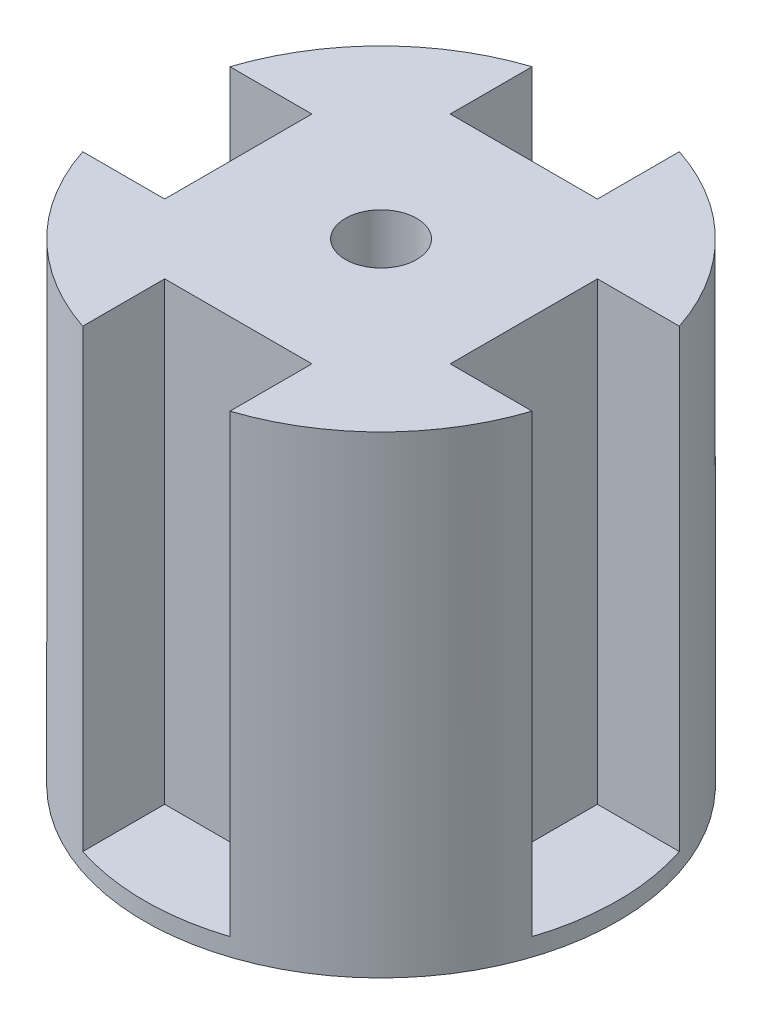
ISO-10303-21;
HEADER;
FILE_DESCRIPTION(('STEP AP214'),'2;1');
FILE_NAME('part.step','',(''),(''),'','','');
FILE_SCHEMA(('AUTOMOTIVE_DESIGN { 1 0 10303 214 1 1 1 1 }'));
ENDSEC;
DATA;
#1=APPLICATION_CONTEXT('core data for automotive mechanical design processes');
#2=APPLICATION_PROTOCOL_DEFINITION('international standard','automotive_design',2000,#1);
#3=PRODUCT_CONTEXT('',#1,'mechanical');
#4=PRODUCT('Part','Part','',(#3));
#5=PRODUCT_RELATED_PRODUCT_CATEGORY('part','',(#4));
#6=PRODUCT_DEFINITION_FORMATION('','',#4);
#7=PRODUCT_DEFINITION_CONTEXT('part definition',#1,'design');
#8=PRODUCT_DEFINITION('design','',#6,#7);
#9=PRODUCT_DEFINITION_SHAPE('','',#8);
#10=(LENGTH_UNIT() NAMED_UNIT(*) SI_UNIT(.MILLI.,.METRE.));
#11=(NAMED_UNIT(*) PLANE_ANGLE_UNIT() SI_UNIT($,.RADIAN.));
#12=(NAMED_UNIT(*) SI_UNIT($,.STERADIAN.) SOLID_ANGLE_UNIT());
#13=UNCERTAINTY_MEASURE_WITH_UNIT(LENGTH_MEASURE(1.E-05),#10,'distance_accuracy_value','');
#14=(GEOMETRIC_REPRESENTATION_CONTEXT(3) GLOBAL_UNCERTAINTY_ASSIGNED_CONTEXT((#13)) GLOBAL_UNIT_ASSIGNED_CONTEXT((#10,
#11,#12)) REPRESENTATION_CONTEXT('',''));
#15=CARTESIAN_POINT('',(0.,0.,0.));
#16=DIRECTION('',(0.,0.,1.));
#17=DIRECTION('',(1.,0.,0.));
#18=AXIS2_PLACEMENT_3D('',#15,#16,#17);
#19=CARTESIAN_POINT('',(-25.1830796369308,51.,-8.25000000000002));
#20=DIRECTION('',(0.,0.,-1.));
#21=DIRECTION('',(-1.,0.,0.));
#22=AXIS2_PLACEMENT_3D('',#19,#20,#21);
#23=PLANE('',#22);
#24=DIRECTION('',(1.,0.,0.));
#25=VECTOR('',#24,1.);
#26=CARTESIAN_POINT('',(-25.1830796369308,0.,-8.25000000000002));
#27=LINE('',#26,#25);
#28=CARTESIAN_POINT('',(-25.1830796369308,0.,-8.25000000000002));
#29=VERTEX_POINT('',#28);
#30=CARTESIAN_POINT('',(-15.9999999999999,0.,-8.25000000000017));
#31=VERTEX_POINT('',#30);
#32=EDGE_CURVE('E213',#29,#31,#27,.T.);
#33=ORIENTED_EDGE('',*,*,#32,.T.);
#34=DIRECTION('',(0.,-1.,0.));
#35=VECTOR('',#34,1.);
#36=CARTESIAN_POINT('',(-15.9999999999999,51.,-8.25000000000017));
#37=LINE('',#36,#35);
#38=CARTESIAN_POINT('',(-15.9999999999999,51.,-8.25000000000017));
#39=VERTEX_POINT('',#38);
#40=EDGE_CURVE('E43',#39,#31,#37,.T.);
#41=ORIENTED_EDGE('',*,*,#40,.F.);
#42=DIRECTION('',(1.,0.,0.));
#43=VECTOR('',#42,1.);
#44=CARTESIAN_POINT('',(-25.1830796369308,51.,-8.25000000000002));
#45=LINE('',#44,#43);
#46=CARTESIAN_POINT('',(-25.1830796369308,51.,-8.25000000000002));
#47=VERTEX_POINT('',#46);
#48=EDGE_CURVE('E315',#47,#39,#45,.T.);
#49=ORIENTED_EDGE('',*,*,#48,.F.);
#50=DIRECTION('',(0.,-1.,0.));
#51=VECTOR('',#50,1.);
#52=CARTESIAN_POINT('',(-25.1830796369308,51.,-8.25000000000002));
#53=LINE('',#52,#51);
#54=EDGE_CURVE('E11',#47,#29,#53,.T.);
#55=ORIENTED_EDGE('',*,*,#54,.T.);
#56=EDGE_LOOP('',(#33,#41,#49,#55));
#57=FACE_BOUND('',#56,.T.);
#58=ADVANCED_FACE('F34',(#57),#23,.F.);
#59=CARTESIAN_POINT('',(-16.0000000000001,51.,8.24999999999984));
#60=DIRECTION('',(1.,0.,0.));
#61=DIRECTION('',(0.,0.,-1.));
#62=AXIS2_PLACEMENT_3D('',#59,#60,#61);
#63=PLANE('',#62);
#64=DIRECTION('',(0.,0.,1.));
#65=VECTOR('',#64,1.);
#66=CARTESIAN_POINT('',(-16.0000000000001,0.,8.24999999999984));
#67=LINE('',#66,#65);
#68=CARTESIAN_POINT('',(-16.0000000000001,0.,8.24999999999984));
#69=VERTEX_POINT('',#68);
#70=EDGE_CURVE('E209',#31,#69,#67,.T.);
#71=ORIENTED_EDGE('',*,*,#70,.T.);
#72=DIRECTION('',(0.,-1.,0.));
#73=VECTOR('',#72,1.);
#74=CARTESIAN_POINT('',(-16.0000000000001,51.,8.24999999999984));
#75=LINE('',#74,#73);
#76=CARTESIAN_POINT('',(-16.0000000000001,51.,8.24999999999984));
#77=VERTEX_POINT('',#76);
#78=EDGE_CURVE('E225',#77,#69,#75,.T.);
#79=ORIENTED_EDGE('',*,*,#78,.F.);
#80=DIRECTION('',(0.,0.,1.));
#81=VECTOR('',#80,1.);
#82=CARTESIAN_POINT('',(-16.0000000000001,51.,8.24999999999984));
#83=LINE('',#82,#81);
#84=EDGE_CURVE('E317',#39,#77,#83,.T.);
#85=ORIENTED_EDGE('',*,*,#84,.F.);
#86=ORIENTED_EDGE('',*,*,#40,.T.);
#87=EDGE_LOOP('',(#71,#79,#85,#86));
#88=FACE_BOUND('',#87,.T.);
#89=ADVANCED_FACE('F356',(#88),#63,.F.);
#90=CARTESIAN_POINT('',(-25.1830796369308,51.,8.24999999999999));
#91=DIRECTION('',(0.,0.,1.));
#92=DIRECTION('',(1.,0.,0.));
#93=AXIS2_PLACEMENT_3D('',#90,#91,#92);
#94=PLANE('',#93);
#95=DIRECTION('',(-1.,0.,0.));
#96=VECTOR('',#95,1.);
#97=CARTESIAN_POINT('',(-25.1830796369308,0.,8.24999999999999));
#98=LINE('',#97,#96);
#99=CARTESIAN_POINT('',(-25.1830796369308,0.,8.24999999999999));
#100=VERTEX_POINT('',#99);
#101=EDGE_CURVE('E212',#69,#100,#98,.T.);
#102=ORIENTED_EDGE('',*,*,#101,.T.);
#103=DIRECTION('',(0.,-1.,0.));
#104=VECTOR('',#103,1.);
#105=CARTESIAN_POINT('',(-25.1830796369308,51.,8.24999999999998));
#106=LINE('',#105,#104);
#107=CARTESIAN_POINT('',(-25.1830796369308,51.,8.24999999999998));
#108=VERTEX_POINT('',#107);
#109=EDGE_CURVE('E223',#108,#100,#106,.T.);
#110=ORIENTED_EDGE('',*,*,#109,.F.);
#111=DIRECTION('',(-1.,0.,0.));
#112=VECTOR('',#111,1.);
#113=CARTESIAN_POINT('',(-25.1830796369308,51.,8.24999999999999));
#114=LINE('',#113,#112);
#115=EDGE_CURVE('E322',#77,#108,#114,.T.);
#116=ORIENTED_EDGE('',*,*,#115,.F.);
#117=ORIENTED_EDGE('',*,*,#78,.T.);
#118=EDGE_LOOP('',(#102,#110,#116,#117));
#119=FACE_BOUND('',#118,.T.);
#120=ADVANCED_FACE('F360',(#119),#94,.F.);
#121=CARTESIAN_POINT('',(-8.25,51.,25.1830796369308));
#122=DIRECTION('',(-1.,0.,0.));
#123=DIRECTION('',(0.,0.,1.));
#124=AXIS2_PLACEMENT_3D('',#121,#122,#123);
#125=PLANE('',#124);
#126=DIRECTION('',(0.,0.,-1.));
#127=VECTOR('',#126,1.);
#128=CARTESIAN_POINT('',(-8.25,0.,25.1830796369308));
#129=LINE('',#128,#127);
#130=CARTESIAN_POINT('',(-8.25,0.,25.1830796369308));
#131=VERTEX_POINT('',#130);
#132=CARTESIAN_POINT('',(-8.25000000000012,0.,15.9999999999999));
#133=VERTEX_POINT('',#132);
#134=EDGE_CURVE('E220',#131,#133,#129,.T.);
#135=ORIENTED_EDGE('',*,*,#134,.T.);
#136=DIRECTION('',(0.,-1.,0.));
#137=VECTOR('',#136,1.);
#138=CARTESIAN_POINT('',(-8.25000000000012,51.,15.9999999999999));
#139=LINE('',#138,#137);
#140=CARTESIAN_POINT('',(-8.25000000000012,51.,15.9999999999999));
#141=VERTEX_POINT('',#140);
#142=EDGE_CURVE('E233',#141,#133,#139,.T.);
#143=ORIENTED_EDGE('',*,*,#142,.F.);
#144=DIRECTION('',(0.,0.,-1.));
#145=VECTOR('',#144,1.);
#146=CARTESIAN_POINT('',(-8.25,51.,25.1830796369308));
#147=LINE('',#146,#145);
#148=CARTESIAN_POINT('',(-8.25,51.,25.1830796369308));
#149=VERTEX_POINT('',#148);
#150=EDGE_CURVE('E326',#149,#141,#147,.T.);
#151=ORIENTED_EDGE('',*,*,#150,.F.);
#152=DIRECTION('',(0.,-1.,0.));
#153=VECTOR('',#152,1.);
#154=CARTESIAN_POINT('',(-8.25,51.,25.1830796369308));
#155=LINE('',#154,#153);
#156=EDGE_CURVE('E226',#149,#131,#155,.T.);
#157=ORIENTED_EDGE('',*,*,#156,.T.);
#158=EDGE_LOOP('',(#135,#143,#151,#157));
#159=FACE_BOUND('',#158,.T.);
#160=ADVANCED_FACE('F365',(#159),#125,.F.);
#161=CARTESIAN_POINT('',(8.2499999999999,51.,16.0000000000001));
#162=DIRECTION('',(0.,0.,-1.));
#163=DIRECTION('',(-1.,0.,0.));
#164=AXIS2_PLACEMENT_3D('',#161,#162,#163);
#165=PLANE('',#164);
#166=DIRECTION('',(1.,0.,0.));
#167=VECTOR('',#166,1.);
#168=CARTESIAN_POINT('',(8.2499999999999,0.,16.0000000000001));
#169=LINE('',#168,#167);
#170=CARTESIAN_POINT('',(8.2499999999999,0.,16.0000000000001));
#171=VERTEX_POINT('',#170);
#172=EDGE_CURVE('E216',#133,#171,#169,.T.);
#173=ORIENTED_EDGE('',*,*,#172,.T.);
#174=DIRECTION('',(0.,-1.,0.));
#175=VECTOR('',#174,1.);
#176=CARTESIAN_POINT('',(8.2499999999999,51.,16.0000000000001));
#177=LINE('',#176,#175);
#178=CARTESIAN_POINT('',(8.2499999999999,51.,16.0000000000001));
#179=VERTEX_POINT('',#178);
#180=EDGE_CURVE('E239',#179,#171,#177,.T.);
#181=ORIENTED_EDGE('',*,*,#180,.F.);
#182=DIRECTION('',(1.,0.,0.));
#183=VECTOR('',#182,1.);
#184=CARTESIAN_POINT('',(8.2499999999999,51.,16.0000000000001));
#185=LINE('',#184,#183);
#186=EDGE_CURVE('E328',#141,#179,#185,.T.);
#187=ORIENTED_EDGE('',*,*,#186,.F.);
#188=ORIENTED_EDGE('',*,*,#142,.T.);
#189=EDGE_LOOP('',(#173,#181,#187,#188));
#190=FACE_BOUND('',#189,.T.);
#191=ADVANCED_FACE('F371',(#190),#165,.F.);
#192=CARTESIAN_POINT('',(8.25000000000001,51.,25.1830796369308));
#193=DIRECTION('',(1.,0.,0.));
#194=DIRECTION('',(0.,0.,-1.));
#195=AXIS2_PLACEMENT_3D('',#192,#193,#194);
#196=PLANE('',#195);
#197=DIRECTION('',(0.,0.,1.));
#198=VECTOR('',#197,1.);
#199=CARTESIAN_POINT('',(8.25000000000001,0.,25.1830796369308));
#200=LINE('',#199,#198);
#201=CARTESIAN_POINT('',(8.25000000000001,0.,25.1830796369308));
#202=VERTEX_POINT('',#201);
#203=EDGE_CURVE('E251',#171,#202,#200,.T.);
#204=ORIENTED_EDGE('',*,*,#203,.T.);
#205=DIRECTION('',(0.,-1.,0.));
#206=VECTOR('',#205,1.);
#207=CARTESIAN_POINT('',(8.25000000000001,51.,25.1830796369308));
#208=LINE('',#207,#206);
#209=CARTESIAN_POINT('',(8.25000000000001,51.,25.1830796369308));
#210=VERTEX_POINT('',#209);
#211=EDGE_CURVE('E247',#210,#202,#208,.T.);
#212=ORIENTED_EDGE('',*,*,#211,.F.);
#213=DIRECTION('',(0.,0.,1.));
#214=VECTOR('',#213,1.);
#215=CARTESIAN_POINT('',(8.25000000000001,51.,25.1830796369308));
#216=LINE('',#215,#214);
#217=EDGE_CURVE('E330',#179,#210,#216,.T.);
#218=ORIENTED_EDGE('',*,*,#217,.F.);
#219=ORIENTED_EDGE('',*,*,#180,.T.);
#220=EDGE_LOOP('',(#204,#212,#218,#219));
#221=FACE_BOUND('',#220,.T.);
#222=ADVANCED_FACE('F374',(#221),#196,.F.);
#223=CARTESIAN_POINT('',(25.1830796369308,51.,8.24999999999998));
#224=DIRECTION('',(0.,0.,1.));
#225=DIRECTION('',(1.,0.,0.));
#226=AXIS2_PLACEMENT_3D('',#223,#224,#225);
#227=PLANE('',#226);
#228=DIRECTION('',(-1.,0.,0.));
#229=VECTOR('',#228,1.);
#230=CARTESIAN_POINT('',(25.1830796369308,0.,8.24999999999998));
#231=LINE('',#230,#229);
#232=CARTESIAN_POINT('',(25.1830796369308,0.,8.24999999999998));
#233=VERTEX_POINT('',#232);
#234=CARTESIAN_POINT('',(16.,0.,8.25000000000006));
#235=VERTEX_POINT('',#234);
#236=EDGE_CURVE('E254',#233,#235,#231,.T.);
#237=ORIENTED_EDGE('',*,*,#236,.T.);
#238=DIRECTION('',(0.,-1.,0.));
#239=VECTOR('',#238,1.);
#240=CARTESIAN_POINT('',(16.,51.,8.25000000000006));
#241=LINE('',#240,#239);
#242=CARTESIAN_POINT('',(16.,51.,8.25000000000006));
#243=VERTEX_POINT('',#242);
#244=EDGE_CURVE('E260',#243,#235,#241,.T.);
#245=ORIENTED_EDGE('',*,*,#244,.F.);
#246=DIRECTION('',(-1.,0.,0.));
#247=VECTOR('',#246,1.);
#248=CARTESIAN_POINT('',(25.1830796369308,51.,8.24999999999998));
#249=LINE('',#248,#247);
#250=CARTESIAN_POINT('',(25.1830796369308,51.,8.24999999999998));
#251=VERTEX_POINT('',#250);
#252=EDGE_CURVE('E334',#251,#243,#249,.T.);
#253=ORIENTED_EDGE('',*,*,#252,.F.);
#254=DIRECTION('',(0.,-1.,0.));
#255=VECTOR('',#254,1.);
#256=CARTESIAN_POINT('',(25.1830796369308,51.,8.24999999999998));
#257=LINE('',#256,#255);
#258=EDGE_CURVE('E250',#251,#233,#257,.T.);
#259=ORIENTED_EDGE('',*,*,#258,.T.);
#260=EDGE_LOOP('',(#237,#245,#253,#259));
#261=FACE_BOUND('',#260,.T.);
#262=ADVANCED_FACE('F378',(#261),#227,.F.);
#263=CARTESIAN_POINT('',(16.,51.,-8.24999999999995));
#264=DIRECTION('',(-1.,0.,0.));
#265=DIRECTION('',(0.,0.,1.));
#266=AXIS2_PLACEMENT_3D('',#263,#264,#265);
#267=PLANE('',#266);
#268=DIRECTION('',(0.,0.,-1.));
#269=VECTOR('',#268,1.);
#270=CARTESIAN_POINT('',(16.,0.,-8.24999999999995));
#271=LINE('',#270,#269);
#272=CARTESIAN_POINT('',(16.,0.,-8.24999999999995));
#273=VERTEX_POINT('',#272);
#274=EDGE_CURVE('E186',#235,#273,#271,.T.);
#275=ORIENTED_EDGE('',*,*,#274,.T.);
#276=DIRECTION('',(0.,-1.,0.));
#277=VECTOR('',#276,1.);
#278=CARTESIAN_POINT('',(16.,51.,-8.24999999999995));
#279=LINE('',#278,#277);
#280=CARTESIAN_POINT('',(16.,51.,-8.24999999999995));
#281=VERTEX_POINT('',#280);
#282=EDGE_CURVE('E175',#281,#273,#279,.T.);
#283=ORIENTED_EDGE('',*,*,#282,.F.);
#284=DIRECTION('',(0.,0.,-1.));
#285=VECTOR('',#284,1.);
#286=CARTESIAN_POINT('',(16.,51.,-8.24999999999995));
#287=LINE('',#286,#285);
#288=EDGE_CURVE('E336',#243,#281,#287,.T.);
#289=ORIENTED_EDGE('',*,*,#288,.F.);
#290=ORIENTED_EDGE('',*,*,#244,.T.);
#291=EDGE_LOOP('',(#275,#283,#289,#290));
#292=FACE_BOUND('',#291,.T.);
#293=ADVANCED_FACE('F272',(#292),#267,.F.);
#294=CARTESIAN_POINT('',(25.1830796369308,51.,-8.25000000000003));
#295=DIRECTION('',(0.,0.,-1.));
#296=DIRECTION('',(-1.,0.,0.));
#297=AXIS2_PLACEMENT_3D('',#294,#295,#296);
#298=PLANE('',#297);
#299=DIRECTION('',(1.,0.,0.));
#300=VECTOR('',#299,1.);
#301=CARTESIAN_POINT('',(25.1830796369308,0.,-8.25000000000003));
#302=LINE('',#301,#300);
#303=CARTESIAN_POINT('',(25.1830796369308,0.,-8.25000000000003));
#304=VERTEX_POINT('',#303);
#305=EDGE_CURVE('E154',#273,#304,#302,.T.);
#306=ORIENTED_EDGE('',*,*,#305,.T.);
#307=DIRECTION('',(0.,-1.,0.));
#308=VECTOR('',#307,1.);
#309=CARTESIAN_POINT('',(25.1830796369308,51.,-8.25000000000003));
#310=LINE('',#309,#308);
#311=CARTESIAN_POINT('',(25.1830796369308,51.,-8.25000000000003));
#312=VERTEX_POINT('',#311);
#313=EDGE_CURVE('E172',#312,#304,#310,.T.);
#314=ORIENTED_EDGE('',*,*,#313,.F.);
#315=DIRECTION('',(1.,0.,0.));
#316=VECTOR('',#315,1.);
#317=CARTESIAN_POINT('',(25.1830796369308,51.,-8.25000000000003));
#318=LINE('',#317,#316);
#319=EDGE_CURVE('E279',#281,#312,#318,.T.);
#320=ORIENTED_EDGE('',*,*,#319,.F.);
#321=ORIENTED_EDGE('',*,*,#282,.T.);
#322=EDGE_LOOP('',(#306,#314,#320,#321));
#323=FACE_BOUND('',#322,.T.);
#324=ADVANCED_FACE('F277',(#323),#298,.F.);
#325=CARTESIAN_POINT('',(0.,51.,0.));
#326=DIRECTION('',(0.,-1.,0.));
#327=DIRECTION('',(0.,0.,-1.));
#328=AXIS2_PLACEMENT_3D('',#325,#326,#327);
#329=CYLINDRICAL_SURFACE('',#328,26.5);
#330=ORIENTED_EDGE('',*,*,#313,.T.);
#331=CARTESIAN_POINT('',(0.,0.,0.));
#332=DIRECTION('',(0.,-1.,0.));
#333=DIRECTION('',(0.,0.,-1.));
#334=AXIS2_PLACEMENT_3D('',#331,#332,#333);
#335=CIRCLE('',#334,26.5);
#336=EDGE_CURVE('E294',#304,#233,#335,.T.);
#337=ORIENTED_EDGE('',*,*,#336,.T.);
#338=ORIENTED_EDGE('',*,*,#258,.F.);
#339=CARTESIAN_POINT('',(0.,51.,0.));
#340=DIRECTION('',(0.,1.,0.));
#341=DIRECTION('',(0.,0.,1.));
#342=AXIS2_PLACEMENT_3D('',#339,#340,#341);
#343=CIRCLE('',#342,26.5);
#344=EDGE_CURVE('E332',#210,#251,#343,.T.);
#345=ORIENTED_EDGE('',*,*,#344,.F.);
#346=ORIENTED_EDGE('',*,*,#211,.T.);
#347=EDGE_CURVE('E299',#202,#131,#335,.T.);
#348=ORIENTED_EDGE('',*,*,#347,.T.);
#349=ORIENTED_EDGE('',*,*,#156,.F.);
#350=CARTESIAN_POINT('',(0.,51.,0.));
#351=DIRECTION('',(0.,1.,0.));
#352=DIRECTION('',(0.,0.,1.));
#353=AXIS2_PLACEMENT_3D('',#350,#351,#352);
#354=CIRCLE('',#353,26.5);
#355=EDGE_CURVE('E324',#108,#149,#354,.T.);
#356=ORIENTED_EDGE('',*,*,#355,.F.);
#357=ORIENTED_EDGE('',*,*,#109,.T.);
#358=EDGE_CURVE('E167',#100,#29,#335,.T.);
#359=ORIENTED_EDGE('',*,*,#358,.T.);
#360=ORIENTED_EDGE('',*,*,#54,.F.);
#361=CARTESIAN_POINT('',(0.,51.,0.));
#362=DIRECTION('',(0.,1.,0.));
#363=DIRECTION('',(0.,0.,1.));
#364=AXIS2_PLACEMENT_3D('',#361,#362,#363);
#365=CIRCLE('',#364,26.5);
#366=CARTESIAN_POINT('',(-8.25000000000001,51.,-25.1830796369308));
#367=VERTEX_POINT('',#366);
#368=EDGE_CURVE('E199',#367,#47,#365,.T.);
#369=ORIENTED_EDGE('',*,*,#368,.F.);
#370=DIRECTION('',(0.,-1.,0.));
#371=VECTOR('',#370,1.);
#372=CARTESIAN_POINT('',(-8.25000000000001,51.,-25.1830796369308));
#373=LINE('',#372,#371);
#374=CARTESIAN_POINT('',(-8.25000000000001,0.,-25.1830796369308));
#375=VERTEX_POINT('',#374);
#376=EDGE_CURVE('E166',#367,#375,#373,.T.);
#377=ORIENTED_EDGE('',*,*,#376,.T.);
#378=CARTESIAN_POINT('',(8.25000000000001,0.,-25.1830796369308));
#379=VERTEX_POINT('',#378);
#380=EDGE_CURVE('E146',#375,#379,#335,.T.);
#381=ORIENTED_EDGE('',*,*,#380,.T.);
#382=DIRECTION('',(0.,-1.,0.));
#383=VECTOR('',#382,1.);
#384=CARTESIAN_POINT('',(8.25000000000001,51.,-25.1830796369308));
#385=LINE('',#384,#383);
#386=CARTESIAN_POINT('',(8.25000000000001,51.,-25.1830796369308));
#387=VERTEX_POINT('',#386);
#388=EDGE_CURVE('E163',#387,#379,#385,.T.);
#389=ORIENTED_EDGE('',*,*,#388,.F.);
#390=CARTESIAN_POINT('',(0.,51.,0.));
#391=DIRECTION('',(0.,1.,0.));
#392=DIRECTION('',(0.,0.,1.));
#393=AXIS2_PLACEMENT_3D('',#390,#391,#392);
#394=CIRCLE('',#393,26.5);
#395=EDGE_CURVE('E339',#312,#387,#394,.T.);
#396=ORIENTED_EDGE('',*,*,#395,.F.);
#397=EDGE_LOOP('',(#330,#337,#338,#345,#346,#348,#349,#356,#357,#359,#360,#369,#377,#381,#389,#396));
#398=FACE_BOUND('',#397,.T.);
#399=CARTESIAN_POINT('',(0.,-2.,0.));
#400=DIRECTION('',(0.,-1.,0.));
#401=DIRECTION('',(0.,0.,-1.));
#402=AXIS2_PLACEMENT_3D('',#399,#400,#401);
#403=CIRCLE('',#402,26.5);
#404=CARTESIAN_POINT('',(0.,-2.,-26.5));
#405=VERTEX_POINT('',#404);
#406=EDGE_CURVE('E289',#405,#405,#403,.T.);
#407=ORIENTED_EDGE('',*,*,#406,.F.);
#408=EDGE_LOOP('',(#407));
#409=FACE_BOUND('',#408,.T.);
#410=ADVANCED_FACE('F160',(#398,#409),#329,.T.);
#411=CARTESIAN_POINT('',(8.25000000000001,51.,-25.1830796369308));
#412=DIRECTION('',(1.,0.,0.));
#413=DIRECTION('',(0.,0.,-1.));
#414=AXIS2_PLACEMENT_3D('',#411,#412,#413);
#415=PLANE('',#414);
#416=DIRECTION('',(0.,0.,1.));
#417=VECTOR('',#416,1.);
#418=CARTESIAN_POINT('',(8.25000000000001,0.,-25.1830796369308));
#419=LINE('',#418,#417);
#420=CARTESIAN_POINT('',(8.25000000000001,0.,-16.));
#421=VERTEX_POINT('',#420);
#422=EDGE_CURVE('E143',#379,#421,#419,.T.);
#423=ORIENTED_EDGE('',*,*,#422,.T.);
#424=DIRECTION('',(0.,-1.,0.));
#425=VECTOR('',#424,1.);
#426=CARTESIAN_POINT('',(8.25000000000001,51.,-16.));
#427=LINE('',#426,#425);
#428=CARTESIAN_POINT('',(8.25000000000001,51.,-16.));
#429=VERTEX_POINT('',#428);
#430=EDGE_CURVE('E173',#429,#421,#427,.T.);
#431=ORIENTED_EDGE('',*,*,#430,.F.);
#432=DIRECTION('',(0.,0.,1.));
#433=VECTOR('',#432,1.);
#434=CARTESIAN_POINT('',(8.25000000000001,51.,-25.1830796369308));
#435=LINE('',#434,#433);
#436=EDGE_CURVE('E171',#387,#429,#435,.T.);
#437=ORIENTED_EDGE('',*,*,#436,.F.);
#438=ORIENTED_EDGE('',*,*,#388,.T.);
#439=EDGE_LOOP('',(#423,#431,#437,#438));
#440=FACE_BOUND('',#439,.T.);
#441=ADVANCED_FACE('F170',(#440),#415,.F.);
#442=CARTESIAN_POINT('',(-8.25000000000001,51.,-16.));
#443=DIRECTION('',(0.,0.,1.));
#444=DIRECTION('',(1.,0.,0.));
#445=AXIS2_PLACEMENT_3D('',#442,#443,#444);
#446=PLANE('',#445);
#447=DIRECTION('',(-1.,0.,0.));
#448=VECTOR('',#447,1.);
#449=CARTESIAN_POINT('',(-8.25000000000001,0.,-16.));
#450=LINE('',#449,#448);
#451=CARTESIAN_POINT('',(-8.25000000000001,0.,-16.));
#452=VERTEX_POINT('',#451);
#453=EDGE_CURVE('E149',#421,#452,#450,.T.);
#454=ORIENTED_EDGE('',*,*,#453,.T.);
#455=DIRECTION('',(0.,-1.,0.));
#456=VECTOR('',#455,1.);
#457=CARTESIAN_POINT('',(-8.25000000000001,51.,-16.));
#458=LINE('',#457,#456);
#459=CARTESIAN_POINT('',(-8.25000000000001,51.,-16.));
#460=VERTEX_POINT('',#459);
#461=EDGE_CURVE('E177',#460,#452,#458,.T.);
#462=ORIENTED_EDGE('',*,*,#461,.F.);
#463=DIRECTION('',(-1.,0.,0.));
#464=VECTOR('',#463,1.);
#465=CARTESIAN_POINT('',(-8.25000000000001,51.,-16.));
#466=LINE('',#465,#464);
#467=EDGE_CURVE('E204',#429,#460,#466,.T.);
#468=ORIENTED_EDGE('',*,*,#467,.F.);
#469=ORIENTED_EDGE('',*,*,#430,.T.);
#470=EDGE_LOOP('',(#454,#462,#468,#469));
#471=FACE_BOUND('',#470,.T.);
#472=ADVANCED_FACE('F343',(#471),#446,.F.);
#473=CARTESIAN_POINT('',(-8.25000000000001,51.,-25.1830796369308));
#474=DIRECTION('',(-1.,0.,0.));
#475=DIRECTION('',(0.,0.,1.));
#476=AXIS2_PLACEMENT_3D('',#473,#474,#475);
#477=PLANE('',#476);
#478=DIRECTION('',(0.,0.,-1.));
#479=VECTOR('',#478,1.);
#480=CARTESIAN_POINT('',(-8.25000000000001,0.,-25.1830796369308));
#481=LINE('',#480,#479);
#482=EDGE_CURVE('E193',#452,#375,#481,.T.);
#483=ORIENTED_EDGE('',*,*,#482,.T.);
#484=ORIENTED_EDGE('',*,*,#376,.F.);
#485=DIRECTION('',(0.,0.,-1.));
#486=VECTOR('',#485,1.);
#487=CARTESIAN_POINT('',(-8.25000000000001,51.,-25.1830796369308));
#488=LINE('',#487,#486);
#489=EDGE_CURVE('E51',#460,#367,#488,.T.);
#490=ORIENTED_EDGE('',*,*,#489,.F.);
#491=ORIENTED_EDGE('',*,*,#461,.T.);
#492=EDGE_LOOP('',(#483,#484,#490,#491));
#493=FACE_BOUND('',#492,.T.);
#494=ADVANCED_FACE('F345',(#493),#477,.F.);
#495=CARTESIAN_POINT('',(0.,51.,0.));
#496=DIRECTION('',(0.,1.,0.));
#497=DIRECTION('',(0.,0.,1.));
#498=AXIS2_PLACEMENT_3D('',#495,#496,#497);
#499=PLANE('',#498);
#500=CARTESIAN_POINT('',(0.,51.,0.));
#501=DIRECTION('',(0.,1.,0.));
#502=DIRECTION('',(0.,0.,1.));
#503=AXIS2_PLACEMENT_3D('',#500,#501,#502);
#504=CIRCLE('',#503,4.);
#505=CARTESIAN_POINT('',(0.,51.,4.));
#506=VERTEX_POINT('',#505);
#507=EDGE_CURVE('E303',#506,#506,#504,.T.);
#508=ORIENTED_EDGE('',*,*,#507,.F.);
#509=EDGE_LOOP('',(#508));
#510=FACE_BOUND('',#509,.T.);
#511=ORIENTED_EDGE('',*,*,#368,.T.);
#512=ORIENTED_EDGE('',*,*,#48,.T.);
#513=ORIENTED_EDGE('',*,*,#84,.T.);
#514=ORIENTED_EDGE('',*,*,#115,.T.);
#515=ORIENTED_EDGE('',*,*,#355,.T.);
#516=ORIENTED_EDGE('',*,*,#150,.T.);
#517=ORIENTED_EDGE('',*,*,#186,.T.);
#518=ORIENTED_EDGE('',*,*,#217,.T.);
#519=ORIENTED_EDGE('',*,*,#344,.T.);
#520=ORIENTED_EDGE('',*,*,#252,.T.);
#521=ORIENTED_EDGE('',*,*,#288,.T.);
#522=ORIENTED_EDGE('',*,*,#319,.T.);
#523=ORIENTED_EDGE('',*,*,#395,.T.);
#524=ORIENTED_EDGE('',*,*,#436,.T.);
#525=ORIENTED_EDGE('',*,*,#467,.T.);
#526=ORIENTED_EDGE('',*,*,#489,.T.);
#527=EDGE_LOOP('',(#511,#512,#513,#514,#515,#516,#517,#518,#519,#520,#521,#522,#523,#524,#525,#526));
#528=FACE_BOUND('',#527,.T.);
#529=ADVANCED_FACE('F319',(#510,#528),#499,.T.);
#530=CARTESIAN_POINT('',(0.,0.,0.));
#531=DIRECTION('',(0.,-1.,0.));
#532=DIRECTION('',(0.,0.,-1.));
#533=AXIS2_PLACEMENT_3D('',#530,#531,#532);
#534=PLANE('',#533);
#535=ORIENTED_EDGE('',*,*,#482,.F.);
#536=ORIENTED_EDGE('',*,*,#453,.F.);
#537=ORIENTED_EDGE('',*,*,#422,.F.);
#538=ORIENTED_EDGE('',*,*,#380,.F.);
#539=EDGE_LOOP('',(#535,#536,#537,#538));
#540=FACE_BOUND('',#539,.T.);
#541=ADVANCED_FACE('F145',(#540),#534,.F.);
#542=ORIENTED_EDGE('',*,*,#305,.F.);
#543=ORIENTED_EDGE('',*,*,#274,.F.);
#544=ORIENTED_EDGE('',*,*,#236,.F.);
#545=ORIENTED_EDGE('',*,*,#336,.F.);
#546=EDGE_LOOP('',(#542,#543,#544,#545));
#547=FACE_BOUND('',#546,.T.);
#548=ADVANCED_FACE('F411',(#547),#534,.F.);
#549=ORIENTED_EDGE('',*,*,#203,.F.);
#550=ORIENTED_EDGE('',*,*,#172,.F.);
#551=ORIENTED_EDGE('',*,*,#134,.F.);
#552=ORIENTED_EDGE('',*,*,#347,.F.);
#553=EDGE_LOOP('',(#549,#550,#551,#552));
#554=FACE_BOUND('',#553,.T.);
#555=ADVANCED_FACE('F422',(#554),#534,.F.);
#556=CARTESIAN_POINT('',(0.,-2.,0.));
#557=DIRECTION('',(0.,-1.,0.));
#558=DIRECTION('',(0.,0.,-1.));
#559=AXIS2_PLACEMENT_3D('',#556,#557,#558);
#560=PLANE('',#559);
#561=CARTESIAN_POINT('',(0.,-2.,0.));
#562=DIRECTION('',(0.,1.,0.));
#563=DIRECTION('',(0.,0.,1.));
#564=AXIS2_PLACEMENT_3D('',#561,#562,#563);
#565=CIRCLE('',#564,4.);
#566=CARTESIAN_POINT('',(0.,-2.,4.));
#567=VERTEX_POINT('',#566);
#568=EDGE_CURVE('E168',#567,#567,#565,.T.);
#569=ORIENTED_EDGE('',*,*,#568,.T.);
#570=EDGE_LOOP('',(#569));
#571=FACE_BOUND('',#570,.T.);
#572=ORIENTED_EDGE('',*,*,#406,.T.);
#573=EDGE_LOOP('',(#572));
#574=FACE_BOUND('',#573,.T.);
#575=ADVANCED_FACE('F430',(#571,#574),#560,.T.);
#576=ORIENTED_EDGE('',*,*,#101,.F.);
#577=ORIENTED_EDGE('',*,*,#70,.F.);
#578=ORIENTED_EDGE('',*,*,#32,.F.);
#579=ORIENTED_EDGE('',*,*,#358,.F.);
#580=EDGE_LOOP('',(#576,#577,#578,#579));
#581=FACE_BOUND('',#580,.T.);
#582=ADVANCED_FACE('F413',(#581),#534,.F.);
#583=CARTESIAN_POINT('',(0.,-2.,0.));
#584=DIRECTION('',(0.,1.,0.));
#585=DIRECTION('',(0.,0.,1.));
#586=AXIS2_PLACEMENT_3D('',#583,#584,#585);
#587=CYLINDRICAL_SURFACE('',#586,4.);
#588=ORIENTED_EDGE('',*,*,#568,.F.);
#589=EDGE_LOOP('',(#588));
#590=FACE_BOUND('',#589,.T.);
#591=ORIENTED_EDGE('',*,*,#507,.T.);
#592=EDGE_LOOP('',(#591));
#593=FACE_BOUND('',#592,.T.);
#594=ADVANCED_FACE('F441',(#590,#593),#587,.F.);
#595=CLOSED_SHELL('',(#58,#89,#120,#160,#191,#222,#262,#293,#324,#410,#441,#472,#494,#529,#541,
#548,#555,#575,#582,#594));
#596=MANIFOLD_SOLID_BREP('B2',#595);
#597=ADVANCED_BREP_SHAPE_REPRESENTATION('',(#18,#596),#14);
#598=SHAPE_DEFINITION_REPRESENTATION(#9,#597);
ENDSEC;
END-ISO-10303-21;
